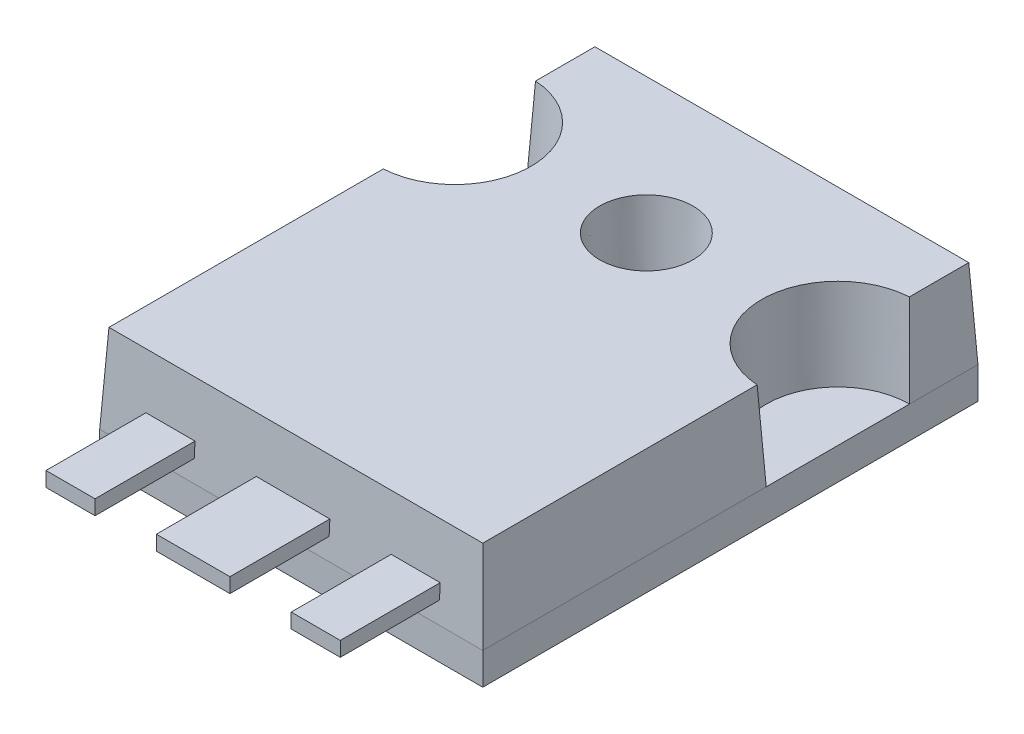
ISO-10303-21;
HEADER;
FILE_DESCRIPTION(('STEP AP214'),'2;1');
FILE_NAME('part.step','',(''),(''),'','','');
FILE_SCHEMA(('AUTOMOTIVE_DESIGN { 1 0 10303 214 1 1 1 1 }'));
ENDSEC;
DATA;
#1=APPLICATION_CONTEXT('core data for automotive mechanical design processes');
#2=APPLICATION_PROTOCOL_DEFINITION('international standard','automotive_design',2000,#1);
#3=PRODUCT_CONTEXT('',#1,'mechanical');
#4=PRODUCT('Part','Part','',(#3));
#5=PRODUCT_RELATED_PRODUCT_CATEGORY('part','',(#4));
#6=PRODUCT_DEFINITION_FORMATION('','',#4);
#7=PRODUCT_DEFINITION_CONTEXT('part definition',#1,'design');
#8=PRODUCT_DEFINITION('design','',#6,#7);
#9=PRODUCT_DEFINITION_SHAPE('','',#8);
#10=(LENGTH_UNIT() NAMED_UNIT(*) SI_UNIT(.MILLI.,.METRE.));
#11=(NAMED_UNIT(*) PLANE_ANGLE_UNIT() SI_UNIT($,.RADIAN.));
#12=(NAMED_UNIT(*) SI_UNIT($,.STERADIAN.) SOLID_ANGLE_UNIT());
#13=UNCERTAINTY_MEASURE_WITH_UNIT(LENGTH_MEASURE(1.E-05),#10,'distance_accuracy_value','');
#14=(GEOMETRIC_REPRESENTATION_CONTEXT(3) GLOBAL_UNCERTAINTY_ASSIGNED_CONTEXT((#13)) GLOBAL_UNIT_ASSIGNED_CONTEXT((#10,
#11,#12)) REPRESENTATION_CONTEXT('',''));
#15=CARTESIAN_POINT('',(0.,0.,0.));
#16=DIRECTION('',(0.,0.,1.));
#17=DIRECTION('',(1.,0.,0.));
#18=AXIS2_PLACEMENT_3D('',#15,#16,#17);
#19=CARTESIAN_POINT('',(0.,1.3,0.));
#20=DIRECTION('',(0.,0.0523359562429439,0.998629534754574));
#21=DIRECTION('',(0.,-0.998629534754574,0.0523359562429439));
#22=AXIS2_PLACEMENT_3D('',#19,#20,#21);
#23=PLANE('',#22);
#24=DIRECTION('',(-1.,0.,0.));
#25=VECTOR('',#24,1.);
#26=CARTESIAN_POINT('',(0.,2.15,-0.0445466123905851));
#27=LINE('',#26,#25);
#28=CARTESIAN_POINT('',(6.3105,2.15,-0.0445466123905851));
#29=VERTEX_POINT('',#28);
#30=CARTESIAN_POINT('',(9.3105,2.15,-0.0445466123905851));
#31=VERTEX_POINT('',#30);
#32=EDGE_CURVE('E441',#29,#31,#27,.F.);
#33=ORIENTED_EDGE('',*,*,#32,.F.);
#34=DIRECTION('',(0.,0.998629534754574,-0.0523359562429439));
#35=VECTOR('',#34,1.);
#36=CARTESIAN_POINT('',(6.3105,1.3,0.));
#37=LINE('',#36,#35);
#38=CARTESIAN_POINT('',(6.3105,2.75,-0.0759912799604098));
#39=VERTEX_POINT('',#38);
#40=EDGE_CURVE('E439',#39,#29,#37,.F.);
#41=ORIENTED_EDGE('',*,*,#40,.F.);
#42=DIRECTION('',(-1.,0.,0.));
#43=VECTOR('',#42,1.);
#44=CARTESIAN_POINT('',(0.,2.75,-0.0759912799604098));
#45=LINE('',#44,#43);
#46=CARTESIAN_POINT('',(9.3105,2.75,-0.0759912799604098));
#47=VERTEX_POINT('',#46);
#48=EDGE_CURVE('E433',#39,#47,#45,.F.);
#49=ORIENTED_EDGE('',*,*,#48,.T.);
#50=DIRECTION('',(0.,0.998629534754574,-0.0523359562429439));
#51=VECTOR('',#50,1.);
#52=CARTESIAN_POINT('',(9.3105,1.3,0.));
#53=LINE('',#52,#51);
#54=EDGE_CURVE('E436',#47,#31,#53,.F.);
#55=ORIENTED_EDGE('',*,*,#54,.T.);
#56=EDGE_LOOP('',(#33,#41,#49,#55));
#57=FACE_BOUND('',#56,.T.);
#58=DIRECTION('',(1.,0.,0.));
#59=VECTOR('',#58,1.);
#60=CARTESIAN_POINT('',(0.,1.3,0.));
#61=LINE('',#60,#59);
#62=CARTESIAN_POINT('',(0.,1.3,0.));
#63=VERTEX_POINT('',#62);
#64=CARTESIAN_POINT('',(15.621,1.3,0.));
#65=VERTEX_POINT('',#64);
#66=EDGE_CURVE('E541',#63,#65,#61,.T.);
#67=ORIENTED_EDGE('',*,*,#66,.T.);
#68=DIRECTION('',(0.052264427688714,-0.997264688634237,0.052264427688714));
#69=VECTOR('',#68,1.);
#70=CARTESIAN_POINT('',(15.621,1.3,0.));
#71=LINE('',#70,#69);
#72=CARTESIAN_POINT('',(15.4323319945811,4.9,-0.188668005418949));
#73=VERTEX_POINT('',#72);
#74=EDGE_CURVE('E345',#73,#65,#71,.T.);
#75=ORIENTED_EDGE('',*,*,#74,.F.);
#76=DIRECTION('',(-1.,0.,0.));
#77=VECTOR('',#76,1.);
#78=CARTESIAN_POINT('',(0.,4.9,-0.188668005418948));
#79=LINE('',#78,#77);
#80=CARTESIAN_POINT('',(0.188668005418948,4.9,-0.188668005418949));
#81=VERTEX_POINT('',#80);
#82=EDGE_CURVE('E521',#81,#73,#79,.F.);
#83=ORIENTED_EDGE('',*,*,#82,.F.);
#84=DIRECTION('',(-0.052264427688714,-0.997264688634237,0.052264427688714));
#85=VECTOR('',#84,1.);
#86=CARTESIAN_POINT('',(0.,1.3,0.));
#87=LINE('',#86,#85);
#88=EDGE_CURVE('E298',#81,#63,#87,.T.);
#89=ORIENTED_EDGE('',*,*,#88,.T.);
#90=EDGE_LOOP('',(#67,#75,#83,#89));
#91=FACE_BOUND('',#90,.T.);
#92=DIRECTION('',(-1.,0.,0.));
#93=VECTOR('',#92,1.);
#94=CARTESIAN_POINT('',(0.,2.15,-0.0445466123905851));
#95=LINE('',#94,#93);
#96=CARTESIAN_POINT('',(1.8105,2.15,-0.0445466123905851));
#97=VERTEX_POINT('',#96);
#98=CARTESIAN_POINT('',(3.8105,2.15,-0.0445466123905851));
#99=VERTEX_POINT('',#98);
#100=EDGE_CURVE('E431',#97,#99,#95,.F.);
#101=ORIENTED_EDGE('',*,*,#100,.F.);
#102=DIRECTION('',(0.,0.998629534754574,-0.0523359562429439));
#103=VECTOR('',#102,1.);
#104=CARTESIAN_POINT('',(1.8105,1.3,0.));
#105=LINE('',#104,#103);
#106=CARTESIAN_POINT('',(1.8105,2.75,-0.0759912799604098));
#107=VERTEX_POINT('',#106);
#108=EDGE_CURVE('E429',#107,#97,#105,.F.);
#109=ORIENTED_EDGE('',*,*,#108,.F.);
#110=DIRECTION('',(-1.,0.,0.));
#111=VECTOR('',#110,1.);
#112=CARTESIAN_POINT('',(0.,2.75,-0.0759912799604098));
#113=LINE('',#112,#111);
#114=CARTESIAN_POINT('',(3.8105,2.75,-0.0759912799604098));
#115=VERTEX_POINT('',#114);
#116=EDGE_CURVE('E423',#107,#115,#113,.F.);
#117=ORIENTED_EDGE('',*,*,#116,.T.);
#118=DIRECTION('',(0.,0.998629534754574,-0.0523359562429439));
#119=VECTOR('',#118,1.);
#120=CARTESIAN_POINT('',(3.8105,1.3,0.));
#121=LINE('',#120,#119);
#122=EDGE_CURVE('E426',#115,#99,#121,.F.);
#123=ORIENTED_EDGE('',*,*,#122,.T.);
#124=EDGE_LOOP('',(#101,#109,#117,#123));
#125=FACE_BOUND('',#124,.T.);
#126=DIRECTION('',(-1.,0.,0.));
#127=VECTOR('',#126,1.);
#128=CARTESIAN_POINT('',(0.,2.15,-0.0445466123905851));
#129=LINE('',#128,#127);
#130=CARTESIAN_POINT('',(11.8105,2.15,-0.0445466123905851));
#131=VERTEX_POINT('',#130);
#132=CARTESIAN_POINT('',(13.8105,2.15,-0.0445466123905851));
#133=VERTEX_POINT('',#132);
#134=EDGE_CURVE('E11',#131,#133,#129,.F.);
#135=ORIENTED_EDGE('',*,*,#134,.F.);
#136=DIRECTION('',(0.,0.998629534754574,-0.0523359562429439));
#137=VECTOR('',#136,1.);
#138=CARTESIAN_POINT('',(11.8105,1.3,0.));
#139=LINE('',#138,#137);
#140=CARTESIAN_POINT('',(11.8105,2.75,-0.0759912799604098));
#141=VERTEX_POINT('',#140);
#142=EDGE_CURVE('E59',#141,#131,#139,.F.);
#143=ORIENTED_EDGE('',*,*,#142,.F.);
#144=DIRECTION('',(-1.,0.,0.));
#145=VECTOR('',#144,1.);
#146=CARTESIAN_POINT('',(0.,2.75,-0.0759912799604098));
#147=LINE('',#146,#145);
#148=CARTESIAN_POINT('',(13.8105,2.75,-0.0759912799604098));
#149=VERTEX_POINT('',#148);
#150=EDGE_CURVE('E218',#141,#149,#147,.F.);
#151=ORIENTED_EDGE('',*,*,#150,.T.);
#152=DIRECTION('',(0.,0.998629534754574,-0.0523359562429439));
#153=VECTOR('',#152,1.);
#154=CARTESIAN_POINT('',(13.8105,1.3,0.));
#155=LINE('',#154,#153);
#156=EDGE_CURVE('E444',#149,#133,#155,.F.);
#157=ORIENTED_EDGE('',*,*,#156,.T.);
#158=EDGE_LOOP('',(#135,#143,#151,#157));
#159=FACE_BOUND('',#158,.T.);
#160=ADVANCED_FACE('F51',(#57,#91,#125,#159),#23,.T.);
#161=CARTESIAN_POINT('',(0.,1.3,0.));
#162=DIRECTION('',(0.,-1.,0.));
#163=DIRECTION('',(0.,0.,-1.));
#164=AXIS2_PLACEMENT_3D('',#161,#162,#163);
#165=PLANE('',#164);
#166=DIRECTION('',(0.,0.,1.));
#167=VECTOR('',#166,1.);
#168=CARTESIAN_POINT('',(0.,1.3,0.));
#169=LINE('',#168,#167);
#170=CARTESIAN_POINT('',(0.,1.3,-17.3995));
#171=VERTEX_POINT('',#170);
#172=CARTESIAN_POINT('',(0.,1.3,-11.5575));
#173=VERTEX_POINT('',#172);
#174=EDGE_CURVE('E413',#171,#173,#169,.T.);
#175=ORIENTED_EDGE('',*,*,#174,.T.);
#176=CARTESIAN_POINT('',(0.,1.3,-14.4785));
#177=DIRECTION('',(0.,1.,0.));
#178=DIRECTION('',(0.,0.,1.));
#179=AXIS2_PLACEMENT_3D('',#176,#177,#178);
#180=CIRCLE('',#179,2.921);
#181=EDGE_CURVE('E273',#173,#171,#180,.T.);
#182=ORIENTED_EDGE('',*,*,#181,.T.);
#183=EDGE_LOOP('',(#175,#182));
#184=FACE_BOUND('',#183,.T.);
#185=ADVANCED_FACE('F360',(#184),#165,.F.);
#186=DIRECTION('',(0.,0.,-1.));
#187=VECTOR('',#186,1.);
#188=CARTESIAN_POINT('',(15.621,1.3,0.));
#189=LINE('',#188,#187);
#190=CARTESIAN_POINT('',(15.621,1.3,-11.5575));
#191=VERTEX_POINT('',#190);
#192=CARTESIAN_POINT('',(15.621,1.3,-17.3995));
#193=VERTEX_POINT('',#192);
#194=EDGE_CURVE('E544',#191,#193,#189,.T.);
#195=ORIENTED_EDGE('',*,*,#194,.T.);
#196=CARTESIAN_POINT('',(15.621,1.3,-14.4785));
#197=DIRECTION('',(0.,1.,0.));
#198=DIRECTION('',(0.,0.,1.));
#199=AXIS2_PLACEMENT_3D('',#196,#197,#198);
#200=CIRCLE('',#199,2.921);
#201=EDGE_CURVE('E279',#193,#191,#200,.T.);
#202=ORIENTED_EDGE('',*,*,#201,.T.);
#203=EDGE_LOOP('',(#195,#202));
#204=FACE_BOUND('',#203,.T.);
#205=ADVANCED_FACE('F369',(#204),#165,.F.);
#206=CARTESIAN_POINT('',(0.,0.,0.));
#207=DIRECTION('',(0.,-1.,0.));
#208=DIRECTION('',(0.,0.,-1.));
#209=AXIS2_PLACEMENT_3D('',#206,#207,#208);
#210=PLANE('',#209);
#211=DIRECTION('',(0.,0.,1.));
#212=VECTOR('',#211,1.);
#213=CARTESIAN_POINT('',(0.,0.,0.));
#214=LINE('',#213,#212);
#215=CARTESIAN_POINT('',(0.,0.,-20.193));
#216=VERTEX_POINT('',#215);
#217=CARTESIAN_POINT('',(0.,0.,0.));
#218=VERTEX_POINT('',#217);
#219=EDGE_CURVE('E401',#216,#218,#214,.T.);
#220=ORIENTED_EDGE('',*,*,#219,.F.);
#221=DIRECTION('',(-1.,0.,0.));
#222=VECTOR('',#221,1.);
#223=CARTESIAN_POINT('',(0.,0.,-20.193));
#224=LINE('',#223,#222);
#225=CARTESIAN_POINT('',(15.621,0.,-20.193));
#226=VERTEX_POINT('',#225);
#227=EDGE_CURVE('E411',#226,#216,#224,.T.);
#228=ORIENTED_EDGE('',*,*,#227,.F.);
#229=DIRECTION('',(0.,0.,-1.));
#230=VECTOR('',#229,1.);
#231=CARTESIAN_POINT('',(15.621,0.,0.));
#232=LINE('',#231,#230);
#233=CARTESIAN_POINT('',(15.621,0.,0.));
#234=VERTEX_POINT('',#233);
#235=EDGE_CURVE('E400',#234,#226,#232,.T.);
#236=ORIENTED_EDGE('',*,*,#235,.F.);
#237=DIRECTION('',(1.,0.,0.));
#238=VECTOR('',#237,1.);
#239=CARTESIAN_POINT('',(0.,0.,0.));
#240=LINE('',#239,#238);
#241=EDGE_CURVE('E390',#218,#234,#240,.T.);
#242=ORIENTED_EDGE('',*,*,#241,.F.);
#243=EDGE_LOOP('',(#220,#228,#236,#242));
#244=FACE_BOUND('',#243,.T.);
#245=CARTESIAN_POINT('',(7.8105,0.,-14.4785));
#246=DIRECTION('',(0.,1.,0.));
#247=DIRECTION('',(0.,0.,1.));
#248=AXIS2_PLACEMENT_3D('',#245,#246,#247);
#249=CIRCLE('',#248,1.7145);
#250=CARTESIAN_POINT('',(7.8105,0.,-12.764));
#251=VERTEX_POINT('',#250);
#252=EDGE_CURVE('E297',#251,#251,#249,.T.);
#253=ORIENTED_EDGE('',*,*,#252,.T.);
#254=EDGE_LOOP('',(#253));
#255=FACE_BOUND('',#254,.T.);
#256=ADVANCED_FACE('F371',(#244,#255),#210,.T.);
#257=CARTESIAN_POINT('',(0.,1.3,0.));
#258=DIRECTION('',(1.,0.,0.));
#259=DIRECTION('',(0.,0.,-1.));
#260=AXIS2_PLACEMENT_3D('',#257,#258,#259);
#261=PLANE('',#260);
#262=ORIENTED_EDGE('',*,*,#219,.T.);
#263=DIRECTION('',(0.,-1.,0.));
#264=VECTOR('',#263,1.);
#265=CARTESIAN_POINT('',(0.,1.3,0.));
#266=LINE('',#265,#264);
#267=EDGE_CURVE('E396',#63,#218,#266,.T.);
#268=ORIENTED_EDGE('',*,*,#267,.F.);
#269=DIRECTION('',(0.,0.,1.));
#270=VECTOR('',#269,1.);
#271=CARTESIAN_POINT('',(0.,1.3,0.));
#272=LINE('',#271,#270);
#273=EDGE_CURVE('E276',#173,#63,#272,.T.);
#274=ORIENTED_EDGE('',*,*,#273,.F.);
#275=ORIENTED_EDGE('',*,*,#174,.F.);
#276=CARTESIAN_POINT('',(0.,1.3,-20.193));
#277=VERTEX_POINT('',#276);
#278=EDGE_CURVE('E538',#277,#171,#169,.T.);
#279=ORIENTED_EDGE('',*,*,#278,.F.);
#280=DIRECTION('',(0.,-1.,0.));
#281=VECTOR('',#280,1.);
#282=CARTESIAN_POINT('',(0.,1.3,-20.193));
#283=LINE('',#282,#281);
#284=EDGE_CURVE('E417',#277,#216,#283,.T.);
#285=ORIENTED_EDGE('',*,*,#284,.T.);
#286=EDGE_LOOP('',(#262,#268,#274,#275,#279,#285));
#287=FACE_BOUND('',#286,.T.);
#288=ADVANCED_FACE('F53',(#287),#261,.F.);
#289=CARTESIAN_POINT('',(0.,1.3,0.));
#290=DIRECTION('',(0.,0.,-1.));
#291=DIRECTION('',(-1.,0.,0.));
#292=AXIS2_PLACEMENT_3D('',#289,#290,#291);
#293=PLANE('',#292);
#294=ORIENTED_EDGE('',*,*,#241,.T.);
#295=DIRECTION('',(0.,-1.,0.));
#296=VECTOR('',#295,1.);
#297=CARTESIAN_POINT('',(15.621,1.3,0.));
#298=LINE('',#297,#296);
#299=EDGE_CURVE('E393',#65,#234,#298,.T.);
#300=ORIENTED_EDGE('',*,*,#299,.F.);
#301=ORIENTED_EDGE('',*,*,#66,.F.);
#302=ORIENTED_EDGE('',*,*,#267,.T.);
#303=EDGE_LOOP('',(#294,#300,#301,#302));
#304=FACE_BOUND('',#303,.T.);
#305=ADVANCED_FACE('F380',(#304),#293,.F.);
#306=CARTESIAN_POINT('',(15.621,1.3,0.));
#307=DIRECTION('',(-1.,0.,0.));
#308=DIRECTION('',(0.,0.,1.));
#309=AXIS2_PLACEMENT_3D('',#306,#307,#308);
#310=PLANE('',#309);
#311=ORIENTED_EDGE('',*,*,#235,.T.);
#312=DIRECTION('',(0.,-1.,0.));
#313=VECTOR('',#312,1.);
#314=CARTESIAN_POINT('',(15.621,1.3,-20.193));
#315=LINE('',#314,#313);
#316=CARTESIAN_POINT('',(15.621,1.3,-20.193));
#317=VERTEX_POINT('',#316);
#318=EDGE_CURVE('E407',#317,#226,#315,.T.);
#319=ORIENTED_EDGE('',*,*,#318,.F.);
#320=DIRECTION('',(0.,0.,-1.));
#321=VECTOR('',#320,1.);
#322=CARTESIAN_POINT('',(15.621,1.3,0.));
#323=LINE('',#322,#321);
#324=EDGE_CURVE('E282',#193,#317,#323,.T.);
#325=ORIENTED_EDGE('',*,*,#324,.F.);
#326=ORIENTED_EDGE('',*,*,#194,.F.);
#327=EDGE_CURVE('E406',#65,#191,#189,.T.);
#328=ORIENTED_EDGE('',*,*,#327,.F.);
#329=ORIENTED_EDGE('',*,*,#299,.T.);
#330=EDGE_LOOP('',(#311,#319,#325,#326,#328,#329));
#331=FACE_BOUND('',#330,.T.);
#332=ADVANCED_FACE('F377',(#331),#310,.F.);
#333=CARTESIAN_POINT('',(0.,1.3,-20.193));
#334=DIRECTION('',(0.,0.,1.));
#335=DIRECTION('',(1.,0.,0.));
#336=AXIS2_PLACEMENT_3D('',#333,#334,#335);
#337=PLANE('',#336);
#338=ORIENTED_EDGE('',*,*,#227,.T.);
#339=ORIENTED_EDGE('',*,*,#284,.F.);
#340=DIRECTION('',(-1.,0.,0.));
#341=VECTOR('',#340,1.);
#342=CARTESIAN_POINT('',(0.,1.3,-20.193));
#343=LINE('',#342,#341);
#344=EDGE_CURVE('E420',#317,#277,#343,.T.);
#345=ORIENTED_EDGE('',*,*,#344,.F.);
#346=ORIENTED_EDGE('',*,*,#318,.T.);
#347=EDGE_LOOP('',(#338,#339,#345,#346));
#348=FACE_BOUND('',#347,.T.);
#349=ADVANCED_FACE('F365',(#348),#337,.F.);
#350=CARTESIAN_POINT('',(7.8105,1.3,-14.4785));
#351=DIRECTION('',(0.,-1.,0.));
#352=DIRECTION('',(0.,0.,-1.));
#353=AXIS2_PLACEMENT_3D('',#350,#351,#352);
#354=CYLINDRICAL_SURFACE('',#353,1.7145);
#355=CARTESIAN_POINT('',(7.8105,1.3,-14.4785));
#356=DIRECTION('',(0.,1.,0.));
#357=DIRECTION('',(0.,0.,1.));
#358=AXIS2_PLACEMENT_3D('',#355,#356,#357);
#359=CIRCLE('',#358,1.7145);
#360=CARTESIAN_POINT('',(7.8105,1.3,-12.764));
#361=VERTEX_POINT('',#360);
#362=EDGE_CURVE('E269',#361,#361,#359,.F.);
#363=ORIENTED_EDGE('',*,*,#362,.F.);
#364=EDGE_LOOP('',(#363));
#365=FACE_BOUND('',#364,.T.);
#366=ORIENTED_EDGE('',*,*,#252,.F.);
#367=EDGE_LOOP('',(#366));
#368=FACE_BOUND('',#367,.T.);
#369=ADVANCED_FACE('F362',(#365,#368),#354,.F.);
#370=CARTESIAN_POINT('',(0.,1.3,-14.4785));
#371=DIRECTION('',(0.,1.,0.));
#372=DIRECTION('',(0.,0.,1.));
#373=AXIS2_PLACEMENT_3D('',#370,#371,#372);
#374=CONICAL_SURFACE('',#373,2.921,0.0523598775598299);
#375=ORIENTED_EDGE('',*,*,#181,.F.);
#376=CARTESIAN_POINT('',(0.188668005418947,4.9,-11.3745606501322));
#377=CARTESIAN_POINT('',(0.157220886528015,4.2999532260069,-11.4041273452191));
#378=CARTESIAN_POINT('',(0.125774993588073,3.69992984455219,-11.4341556382947));
#379=CARTESIAN_POINT('',(0.0628856584483328,2.49992984455047,-11.4951354215499));
#380=CARTESIAN_POINT('',(0.0314422162486257,1.89995322600517,-11.5260869117635));
#381=CARTESIAN_POINT('',(0.,1.3,-11.5575));
#382=B_SPLINE_CURVE_WITH_KNOTS('',3,(#376,#377,#378,#379,#380,#381),.UNSPECIFIED.,.F.,.F.,(4,2,
4),(0.,1.80479012844749,3.60958032357924),.UNSPECIFIED.);
#383=CARTESIAN_POINT('',(0.188668005418947,4.9,-11.3745606501322));
#384=VERTEX_POINT('',#383);
#385=EDGE_CURVE('E289',#384,#173,#382,.T.);
#386=ORIENTED_EDGE('',*,*,#385,.F.);
#387=CARTESIAN_POINT('',(0.,4.9,-14.4785));
#388=DIRECTION('',(0.,1.,0.));
#389=DIRECTION('',(0.,0.,1.));
#390=AXIS2_PLACEMENT_3D('',#387,#388,#389);
#391=CIRCLE('',#390,3.10966800541895);
#392=CARTESIAN_POINT('',(0.188668005418945,4.9,-17.5824393498678));
#393=VERTEX_POINT('',#392);
#394=EDGE_CURVE('E288',#384,#393,#391,.T.);
#395=ORIENTED_EDGE('',*,*,#394,.T.);
#396=CARTESIAN_POINT('',(0.188668005418945,4.9,-17.5824393498678));
#397=CARTESIAN_POINT('',(0.157220886528014,4.2999532260069,-17.5528726547809));
#398=CARTESIAN_POINT('',(0.125774993588072,3.69992984455219,-17.5228443617053));
#399=CARTESIAN_POINT('',(0.0628856584483318,2.49992984455047,-17.4618645784501));
#400=CARTESIAN_POINT('',(0.0314422162486247,1.89995322600517,-17.4309130882365));
#401=CARTESIAN_POINT('',(0.,1.3,-17.3995));
#402=B_SPLINE_CURVE_WITH_KNOTS('',3,(#396,#397,#398,#399,#400,#401),.UNSPECIFIED.,.F.,.F.,(4,2,
4),(0.,1.80479012844749,3.60958032357924),.UNSPECIFIED.);
#403=EDGE_CURVE('E299',#393,#171,#402,.T.);
#404=ORIENTED_EDGE('',*,*,#403,.T.);
#405=EDGE_LOOP('',(#375,#386,#395,#404));
#406=FACE_BOUND('',#405,.T.);
#407=ADVANCED_FACE('F306',(#406),#374,.F.);
#408=CARTESIAN_POINT('',(0.,1.3,0.));
#409=DIRECTION('',(-0.998629534754574,0.0523359562429439,0.));
#410=DIRECTION('',(-0.0523359562429439,-0.998629534754574,0.));
#411=AXIS2_PLACEMENT_3D('',#408,#409,#410);
#412=PLANE('',#411);
#413=ORIENTED_EDGE('',*,*,#273,.T.);
#414=ORIENTED_EDGE('',*,*,#88,.F.);
#415=DIRECTION('',(0.,0.,-1.));
#416=VECTOR('',#415,1.);
#417=CARTESIAN_POINT('',(0.188668005418948,4.9,0.));
#418=LINE('',#417,#416);
#419=EDGE_CURVE('E514',#384,#81,#418,.F.);
#420=ORIENTED_EDGE('',*,*,#419,.F.);
#421=ORIENTED_EDGE('',*,*,#385,.T.);
#422=EDGE_LOOP('',(#413,#414,#420,#421));
#423=FACE_BOUND('',#422,.T.);
#424=ADVANCED_FACE('F309',(#423),#412,.T.);
#425=CARTESIAN_POINT('',(15.621,1.3,0.));
#426=DIRECTION('',(0.998629534754574,0.0523359562429439,0.));
#427=DIRECTION('',(-0.0523359562429439,0.998629534754574,0.));
#428=AXIS2_PLACEMENT_3D('',#425,#426,#427);
#429=PLANE('',#428);
#430=ORIENTED_EDGE('',*,*,#327,.T.);
#431=CARTESIAN_POINT('',(15.432331994581,4.9,-11.3745606501322));
#432=CARTESIAN_POINT('',(15.463779113472,4.2999532260069,-11.4041273452191));
#433=CARTESIAN_POINT('',(15.4952250064119,3.69992984455219,-11.4341556382947));
#434=CARTESIAN_POINT('',(15.5581143415517,2.49992984455047,-11.4951354215499));
#435=CARTESIAN_POINT('',(15.5895577837514,1.89995322600517,-11.5260869117635));
#436=CARTESIAN_POINT('',(15.621,1.3,-11.5575));
#437=B_SPLINE_CURVE_WITH_KNOTS('',3,(#431,#432,#433,#434,#435,#436),.UNSPECIFIED.,.F.,.F.,(4,2,
4),(0.,1.80479012844749,3.60958032357924),.UNSPECIFIED.);
#438=CARTESIAN_POINT('',(15.432331994581,4.9,-11.3745606501322));
#439=VERTEX_POINT('',#438);
#440=EDGE_CURVE('E338',#439,#191,#437,.T.);
#441=ORIENTED_EDGE('',*,*,#440,.F.);
#442=DIRECTION('',(0.,0.,1.));
#443=VECTOR('',#442,1.);
#444=CARTESIAN_POINT('',(15.4323319945811,4.9,0.));
#445=LINE('',#444,#443);
#446=EDGE_CURVE('E525',#73,#439,#445,.F.);
#447=ORIENTED_EDGE('',*,*,#446,.F.);
#448=ORIENTED_EDGE('',*,*,#74,.T.);
#449=EDGE_LOOP('',(#430,#441,#447,#448));
#450=FACE_BOUND('',#449,.T.);
#451=ADVANCED_FACE('F312',(#450),#429,.T.);
#452=CARTESIAN_POINT('',(15.621,1.3,-14.4785));
#453=DIRECTION('',(0.,1.,0.));
#454=DIRECTION('',(0.,0.,1.));
#455=AXIS2_PLACEMENT_3D('',#452,#453,#454);
#456=CONICAL_SURFACE('',#455,2.921,0.0523598775598299);
#457=ORIENTED_EDGE('',*,*,#201,.F.);
#458=CARTESIAN_POINT('',(15.432331994581,4.9,-17.5824393498678));
#459=CARTESIAN_POINT('',(15.463779113472,4.2999532260069,-17.5528726547809));
#460=CARTESIAN_POINT('',(15.4952250064119,3.69992984455219,-17.5228443617053));
#461=CARTESIAN_POINT('',(15.5581143415517,2.49992984455047,-17.4618645784501));
#462=CARTESIAN_POINT('',(15.5895577837514,1.89995322600517,-17.4309130882365));
#463=CARTESIAN_POINT('',(15.621,1.3,-17.3995));
#464=B_SPLINE_CURVE_WITH_KNOTS('',3,(#458,#459,#460,#461,#462,#463),.UNSPECIFIED.,.F.,.F.,(4,2,
4),(0.,1.80479012844749,3.60958032357924),.UNSPECIFIED.);
#465=CARTESIAN_POINT('',(15.432331994581,4.9,-17.5824393498678));
#466=VERTEX_POINT('',#465);
#467=EDGE_CURVE('E331',#466,#193,#464,.T.);
#468=ORIENTED_EDGE('',*,*,#467,.F.);
#469=CARTESIAN_POINT('',(15.621,4.9,-14.4785));
#470=DIRECTION('',(0.,1.,0.));
#471=DIRECTION('',(0.,0.,1.));
#472=AXIS2_PLACEMENT_3D('',#469,#470,#471);
#473=CIRCLE('',#472,3.10966800541895);
#474=EDGE_CURVE('E527',#466,#439,#473,.T.);
#475=ORIENTED_EDGE('',*,*,#474,.T.);
#476=ORIENTED_EDGE('',*,*,#440,.T.);
#477=EDGE_LOOP('',(#457,#468,#475,#476));
#478=FACE_BOUND('',#477,.T.);
#479=ADVANCED_FACE('F321',(#478),#456,.F.);
#480=CARTESIAN_POINT('',(15.621,1.3,0.));
#481=DIRECTION('',(0.998629534754574,0.0523359562429439,0.));
#482=DIRECTION('',(-0.0523359562429439,0.998629534754574,0.));
#483=AXIS2_PLACEMENT_3D('',#480,#481,#482);
#484=PLANE('',#483);
#485=ORIENTED_EDGE('',*,*,#324,.T.);
#486=DIRECTION('',(0.052264427688714,-0.997264688634237,-0.052264427688714));
#487=VECTOR('',#486,1.);
#488=CARTESIAN_POINT('',(15.5783301387562,2.11418945484018,-20.1503301387562));
#489=LINE('',#488,#487);
#490=CARTESIAN_POINT('',(15.432331994581,4.9,-20.0043319945811));
#491=VERTEX_POINT('',#490);
#492=EDGE_CURVE('E568',#491,#317,#489,.T.);
#493=ORIENTED_EDGE('',*,*,#492,.F.);
#494=DIRECTION('',(0.,0.,1.));
#495=VECTOR('',#494,1.);
#496=CARTESIAN_POINT('',(15.4323319945811,4.9,0.));
#497=LINE('',#496,#495);
#498=EDGE_CURVE('E530',#466,#491,#497,.F.);
#499=ORIENTED_EDGE('',*,*,#498,.F.);
#500=ORIENTED_EDGE('',*,*,#467,.T.);
#501=EDGE_LOOP('',(#485,#493,#499,#500));
#502=FACE_BOUND('',#501,.T.);
#503=ADVANCED_FACE('F325',(#502),#484,.T.);
#504=CARTESIAN_POINT('',(0.,1.3,-20.193));
#505=DIRECTION('',(0.,0.0523359562429439,-0.998629534754574));
#506=DIRECTION('',(0.,0.998629534754574,0.0523359562429439));
#507=AXIS2_PLACEMENT_3D('',#504,#505,#506);
#508=PLANE('',#507);
#509=ORIENTED_EDGE('',*,*,#344,.T.);
#510=DIRECTION('',(-0.052264427688714,-0.997264688634237,-0.052264427688714));
#511=VECTOR('',#510,1.);
#512=CARTESIAN_POINT('',(0.0551586011200871,2.35248880747633,-20.1378413988799));
#513=LINE('',#512,#511);
#514=CARTESIAN_POINT('',(0.188668005418945,4.9,-20.0043319945811));
#515=VERTEX_POINT('',#514);
#516=EDGE_CURVE('E566',#515,#277,#513,.T.);
#517=ORIENTED_EDGE('',*,*,#516,.F.);
#518=DIRECTION('',(1.,0.,0.));
#519=VECTOR('',#518,1.);
#520=CARTESIAN_POINT('',(0.,4.9,-20.0043319945811));
#521=LINE('',#520,#519);
#522=EDGE_CURVE('E533',#491,#515,#521,.F.);
#523=ORIENTED_EDGE('',*,*,#522,.F.);
#524=ORIENTED_EDGE('',*,*,#492,.T.);
#525=EDGE_LOOP('',(#509,#517,#523,#524));
#526=FACE_BOUND('',#525,.T.);
#527=ADVANCED_FACE('F353',(#526),#508,.T.);
#528=CARTESIAN_POINT('',(7.8105,1.3,-14.4785));
#529=DIRECTION('',(0.,1.,0.));
#530=DIRECTION('',(0.,0.,1.));
#531=AXIS2_PLACEMENT_3D('',#528,#529,#530);
#532=CONICAL_SURFACE('',#531,1.7145,0.0523598775598299);
#533=CARTESIAN_POINT('',(7.8105,4.9,-14.4785));
#534=DIRECTION('',(0.,1.,0.));
#535=DIRECTION('',(0.,0.,1.));
#536=AXIS2_PLACEMENT_3D('',#533,#534,#535);
#537=CIRCLE('',#536,1.90316800541895);
#538=CARTESIAN_POINT('',(7.8105,4.9,-12.575331994581));
#539=VERTEX_POINT('',#538);
#540=EDGE_CURVE('E285',#539,#539,#537,.F.);
#541=ORIENTED_EDGE('',*,*,#540,.F.);
#542=EDGE_LOOP('',(#541));
#543=FACE_BOUND('',#542,.T.);
#544=ORIENTED_EDGE('',*,*,#362,.T.);
#545=EDGE_LOOP('',(#544));
#546=FACE_BOUND('',#545,.T.);
#547=ADVANCED_FACE('F319',(#543,#546),#532,.F.);
#548=CARTESIAN_POINT('',(0.,1.3,0.));
#549=DIRECTION('',(-0.998629534754574,0.0523359562429439,0.));
#550=DIRECTION('',(-0.0523359562429439,-0.998629534754574,0.));
#551=AXIS2_PLACEMENT_3D('',#548,#549,#550);
#552=PLANE('',#551);
#553=ORIENTED_EDGE('',*,*,#278,.T.);
#554=ORIENTED_EDGE('',*,*,#403,.F.);
#555=DIRECTION('',(0.,0.,-1.));
#556=VECTOR('',#555,1.);
#557=CARTESIAN_POINT('',(0.188668005418948,4.9,0.));
#558=LINE('',#557,#556);
#559=EDGE_CURVE('E517',#515,#393,#558,.F.);
#560=ORIENTED_EDGE('',*,*,#559,.F.);
#561=ORIENTED_EDGE('',*,*,#516,.T.);
#562=EDGE_LOOP('',(#553,#554,#560,#561));
#563=FACE_BOUND('',#562,.T.);
#564=ADVANCED_FACE('F314',(#563),#552,.T.);
#565=CARTESIAN_POINT('',(0.,4.9,0.));
#566=DIRECTION('',(0.,1.,0.));
#567=DIRECTION('',(0.,0.,1.));
#568=AXIS2_PLACEMENT_3D('',#565,#566,#567);
#569=PLANE('',#568);
#570=ORIENTED_EDGE('',*,*,#540,.T.);
#571=EDGE_LOOP('',(#570));
#572=FACE_BOUND('',#571,.T.);
#573=ORIENTED_EDGE('',*,*,#394,.F.);
#574=ORIENTED_EDGE('',*,*,#419,.T.);
#575=ORIENTED_EDGE('',*,*,#82,.T.);
#576=ORIENTED_EDGE('',*,*,#446,.T.);
#577=ORIENTED_EDGE('',*,*,#474,.F.);
#578=ORIENTED_EDGE('',*,*,#498,.T.);
#579=ORIENTED_EDGE('',*,*,#522,.T.);
#580=ORIENTED_EDGE('',*,*,#559,.T.);
#581=EDGE_LOOP('',(#573,#574,#575,#576,#577,#578,#579,#580));
#582=FACE_BOUND('',#581,.T.);
#583=ADVANCED_FACE('F318',(#572,#582),#569,.T.);
#584=CARTESIAN_POINT('',(1.8105,2.15,0.));
#585=DIRECTION('',(1.,0.,0.));
#586=DIRECTION('',(0.,0.,-1.));
#587=AXIS2_PLACEMENT_3D('',#584,#585,#586);
#588=PLANE('',#587);
#589=DIRECTION('',(0.,0.,-1.));
#590=VECTOR('',#589,1.);
#591=CARTESIAN_POINT('',(1.8105,2.75,0.));
#592=LINE('',#591,#590);
#593=CARTESIAN_POINT('',(1.8105,2.75,4.));
#594=VERTEX_POINT('',#593);
#595=EDGE_CURVE('E248',#594,#107,#592,.T.);
#596=ORIENTED_EDGE('',*,*,#595,.T.);
#597=ORIENTED_EDGE('',*,*,#108,.T.);
#598=DIRECTION('',(0.,0.,-1.));
#599=VECTOR('',#598,1.);
#600=CARTESIAN_POINT('',(1.8105,2.15,0.));
#601=LINE('',#600,#599);
#602=CARTESIAN_POINT('',(1.8105,2.15,4.));
#603=VERTEX_POINT('',#602);
#604=EDGE_CURVE('E257',#603,#97,#601,.T.);
#605=ORIENTED_EDGE('',*,*,#604,.F.);
#606=DIRECTION('',(0.,1.,0.));
#607=VECTOR('',#606,1.);
#608=CARTESIAN_POINT('',(1.8105,2.15,4.));
#609=LINE('',#608,#607);
#610=EDGE_CURVE('E266',#603,#594,#609,.T.);
#611=ORIENTED_EDGE('',*,*,#610,.T.);
#612=EDGE_LOOP('',(#596,#597,#605,#611));
#613=FACE_BOUND('',#612,.T.);
#614=ADVANCED_FACE('F496',(#613),#588,.F.);
#615=CARTESIAN_POINT('',(3.8105,2.15,0.));
#616=DIRECTION('',(1.,0.,0.));
#617=DIRECTION('',(0.,0.,-1.));
#618=AXIS2_PLACEMENT_3D('',#615,#616,#617);
#619=PLANE('',#618);
#620=ORIENTED_EDGE('',*,*,#122,.F.);
#621=DIRECTION('',(0.,0.,-1.));
#622=VECTOR('',#621,1.);
#623=CARTESIAN_POINT('',(3.8105,2.75,0.));
#624=LINE('',#623,#622);
#625=CARTESIAN_POINT('',(3.8105,2.75,4.));
#626=VERTEX_POINT('',#625);
#627=EDGE_CURVE('E255',#626,#115,#624,.T.);
#628=ORIENTED_EDGE('',*,*,#627,.F.);
#629=DIRECTION('',(0.,1.,0.));
#630=VECTOR('',#629,1.);
#631=CARTESIAN_POINT('',(3.8105,2.15,4.));
#632=LINE('',#631,#630);
#633=CARTESIAN_POINT('',(3.8105,2.15,4.));
#634=VERTEX_POINT('',#633);
#635=EDGE_CURVE('E267',#634,#626,#632,.T.);
#636=ORIENTED_EDGE('',*,*,#635,.F.);
#637=DIRECTION('',(0.,0.,-1.));
#638=VECTOR('',#637,1.);
#639=CARTESIAN_POINT('',(3.8105,2.15,0.));
#640=LINE('',#639,#638);
#641=EDGE_CURVE('E263',#634,#99,#640,.T.);
#642=ORIENTED_EDGE('',*,*,#641,.T.);
#643=EDGE_LOOP('',(#620,#628,#636,#642));
#644=FACE_BOUND('',#643,.T.);
#645=ADVANCED_FACE('F492',(#644),#619,.T.);
#646=CARTESIAN_POINT('',(0.,2.15,0.));
#647=DIRECTION('',(0.,1.,0.));
#648=DIRECTION('',(0.,0.,1.));
#649=AXIS2_PLACEMENT_3D('',#646,#647,#648);
#650=PLANE('',#649);
#651=ORIENTED_EDGE('',*,*,#604,.T.);
#652=ORIENTED_EDGE('',*,*,#100,.T.);
#653=ORIENTED_EDGE('',*,*,#641,.F.);
#654=DIRECTION('',(1.,0.,0.));
#655=VECTOR('',#654,1.);
#656=CARTESIAN_POINT('',(0.,2.15,4.));
#657=LINE('',#656,#655);
#658=EDGE_CURVE('E260',#603,#634,#657,.T.);
#659=ORIENTED_EDGE('',*,*,#658,.F.);
#660=EDGE_LOOP('',(#651,#652,#653,#659));
#661=FACE_BOUND('',#660,.T.);
#662=ADVANCED_FACE('F488',(#661),#650,.F.);
#663=CARTESIAN_POINT('',(0.,2.75,0.));
#664=DIRECTION('',(0.,1.,0.));
#665=DIRECTION('',(0.,0.,1.));
#666=AXIS2_PLACEMENT_3D('',#663,#664,#665);
#667=PLANE('',#666);
#668=ORIENTED_EDGE('',*,*,#116,.F.);
#669=ORIENTED_EDGE('',*,*,#595,.F.);
#670=DIRECTION('',(1.,0.,0.));
#671=VECTOR('',#670,1.);
#672=CARTESIAN_POINT('',(0.,2.75,4.));
#673=LINE('',#672,#671);
#674=EDGE_CURVE('E252',#594,#626,#673,.T.);
#675=ORIENTED_EDGE('',*,*,#674,.T.);
#676=ORIENTED_EDGE('',*,*,#627,.T.);
#677=EDGE_LOOP('',(#668,#669,#675,#676));
#678=FACE_BOUND('',#677,.T.);
#679=ADVANCED_FACE('F485',(#678),#667,.T.);
#680=CARTESIAN_POINT('',(0.,2.15,4.));
#681=DIRECTION('',(0.,0.,1.));
#682=DIRECTION('',(1.,0.,0.));
#683=AXIS2_PLACEMENT_3D('',#680,#681,#682);
#684=PLANE('',#683);
#685=ORIENTED_EDGE('',*,*,#635,.T.);
#686=ORIENTED_EDGE('',*,*,#674,.F.);
#687=ORIENTED_EDGE('',*,*,#610,.F.);
#688=ORIENTED_EDGE('',*,*,#658,.T.);
#689=EDGE_LOOP('',(#685,#686,#687,#688));
#690=FACE_BOUND('',#689,.T.);
#691=ADVANCED_FACE('F483',(#690),#684,.T.);
#692=CARTESIAN_POINT('',(6.3105,2.15,0.));
#693=DIRECTION('',(1.,0.,0.));
#694=DIRECTION('',(0.,0.,-1.));
#695=AXIS2_PLACEMENT_3D('',#692,#693,#694);
#696=PLANE('',#695);
#697=DIRECTION('',(0.,0.,-1.));
#698=VECTOR('',#697,1.);
#699=CARTESIAN_POINT('',(6.3105,2.75,0.));
#700=LINE('',#699,#698);
#701=CARTESIAN_POINT('',(6.3105,2.75,4.));
#702=VERTEX_POINT('',#701);
#703=EDGE_CURVE('E229',#702,#39,#700,.T.);
#704=ORIENTED_EDGE('',*,*,#703,.T.);
#705=ORIENTED_EDGE('',*,*,#40,.T.);
#706=DIRECTION('',(0.,0.,-1.));
#707=VECTOR('',#706,1.);
#708=CARTESIAN_POINT('',(6.3105,2.15,0.));
#709=LINE('',#708,#707);
#710=CARTESIAN_POINT('',(6.3105,2.15,4.));
#711=VERTEX_POINT('',#710);
#712=EDGE_CURVE('E237',#711,#29,#709,.T.);
#713=ORIENTED_EDGE('',*,*,#712,.F.);
#714=DIRECTION('',(0.,1.,0.));
#715=VECTOR('',#714,1.);
#716=CARTESIAN_POINT('',(6.3105,2.15,4.));
#717=LINE('',#716,#715);
#718=EDGE_CURVE('E245',#711,#702,#717,.T.);
#719=ORIENTED_EDGE('',*,*,#718,.T.);
#720=EDGE_LOOP('',(#704,#705,#713,#719));
#721=FACE_BOUND('',#720,.T.);
#722=ADVANCED_FACE('F476',(#721),#696,.F.);
#723=CARTESIAN_POINT('',(9.3105,2.15,0.));
#724=DIRECTION('',(1.,0.,0.));
#725=DIRECTION('',(0.,0.,-1.));
#726=AXIS2_PLACEMENT_3D('',#723,#724,#725);
#727=PLANE('',#726);
#728=ORIENTED_EDGE('',*,*,#54,.F.);
#729=DIRECTION('',(0.,0.,-1.));
#730=VECTOR('',#729,1.);
#731=CARTESIAN_POINT('',(9.3105,2.75,0.));
#732=LINE('',#731,#730);
#733=CARTESIAN_POINT('',(9.3105,2.75,4.));
#734=VERTEX_POINT('',#733);
#735=EDGE_CURVE('E74',#734,#47,#732,.T.);
#736=ORIENTED_EDGE('',*,*,#735,.F.);
#737=DIRECTION('',(0.,1.,0.));
#738=VECTOR('',#737,1.);
#739=CARTESIAN_POINT('',(9.3105,2.15,4.));
#740=LINE('',#739,#738);
#741=CARTESIAN_POINT('',(9.3105,2.15,4.));
#742=VERTEX_POINT('',#741);
#743=EDGE_CURVE('E246',#742,#734,#740,.T.);
#744=ORIENTED_EDGE('',*,*,#743,.F.);
#745=DIRECTION('',(0.,0.,-1.));
#746=VECTOR('',#745,1.);
#747=CARTESIAN_POINT('',(9.3105,2.15,0.));
#748=LINE('',#747,#746);
#749=EDGE_CURVE('E242',#742,#31,#748,.T.);
#750=ORIENTED_EDGE('',*,*,#749,.T.);
#751=EDGE_LOOP('',(#728,#736,#744,#750));
#752=FACE_BOUND('',#751,.T.);
#753=ADVANCED_FACE('F472',(#752),#727,.T.);
#754=CARTESIAN_POINT('',(0.,2.15,0.));
#755=DIRECTION('',(0.,1.,0.));
#756=DIRECTION('',(0.,0.,1.));
#757=AXIS2_PLACEMENT_3D('',#754,#755,#756);
#758=PLANE('',#757);
#759=ORIENTED_EDGE('',*,*,#712,.T.);
#760=ORIENTED_EDGE('',*,*,#32,.T.);
#761=ORIENTED_EDGE('',*,*,#749,.F.);
#762=DIRECTION('',(-1.,0.,0.));
#763=VECTOR('',#762,1.);
#764=CARTESIAN_POINT('',(0.,2.15,4.));
#765=LINE('',#764,#763);
#766=EDGE_CURVE('E240',#742,#711,#765,.T.);
#767=ORIENTED_EDGE('',*,*,#766,.T.);
#768=EDGE_LOOP('',(#759,#760,#761,#767));
#769=FACE_BOUND('',#768,.T.);
#770=ADVANCED_FACE('F469',(#769),#758,.F.);
#771=CARTESIAN_POINT('',(0.,2.75,0.));
#772=DIRECTION('',(0.,1.,0.));
#773=DIRECTION('',(0.,0.,1.));
#774=AXIS2_PLACEMENT_3D('',#771,#772,#773);
#775=PLANE('',#774);
#776=ORIENTED_EDGE('',*,*,#48,.F.);
#777=ORIENTED_EDGE('',*,*,#703,.F.);
#778=DIRECTION('',(-1.,0.,0.));
#779=VECTOR('',#778,1.);
#780=CARTESIAN_POINT('',(0.,2.75,4.));
#781=LINE('',#780,#779);
#782=EDGE_CURVE('E233',#734,#702,#781,.T.);
#783=ORIENTED_EDGE('',*,*,#782,.F.);
#784=ORIENTED_EDGE('',*,*,#735,.T.);
#785=EDGE_LOOP('',(#776,#777,#783,#784));
#786=FACE_BOUND('',#785,.T.);
#787=ADVANCED_FACE('F466',(#786),#775,.T.);
#788=CARTESIAN_POINT('',(0.,2.15,4.));
#789=DIRECTION('',(0.,0.,-1.));
#790=DIRECTION('',(-1.,0.,0.));
#791=AXIS2_PLACEMENT_3D('',#788,#789,#790);
#792=PLANE('',#791);
#793=ORIENTED_EDGE('',*,*,#743,.T.);
#794=ORIENTED_EDGE('',*,*,#782,.T.);
#795=ORIENTED_EDGE('',*,*,#718,.F.);
#796=ORIENTED_EDGE('',*,*,#766,.F.);
#797=EDGE_LOOP('',(#793,#794,#795,#796));
#798=FACE_BOUND('',#797,.T.);
#799=ADVANCED_FACE('F460',(#798),#792,.F.);
#800=CARTESIAN_POINT('',(11.8105,2.15,0.));
#801=DIRECTION('',(1.,0.,0.));
#802=DIRECTION('',(0.,0.,-1.));
#803=AXIS2_PLACEMENT_3D('',#800,#801,#802);
#804=PLANE('',#803);
#805=DIRECTION('',(0.,0.,-1.));
#806=VECTOR('',#805,1.);
#807=CARTESIAN_POINT('',(11.8105,2.75,0.));
#808=LINE('',#807,#806);
#809=CARTESIAN_POINT('',(11.8105,2.75,4.));
#810=VERTEX_POINT('',#809);
#811=EDGE_CURVE('E205',#810,#141,#808,.T.);
#812=ORIENTED_EDGE('',*,*,#811,.T.);
#813=ORIENTED_EDGE('',*,*,#142,.T.);
#814=DIRECTION('',(0.,0.,-1.));
#815=VECTOR('',#814,1.);
#816=CARTESIAN_POINT('',(11.8105,2.15,0.));
#817=LINE('',#816,#815);
#818=CARTESIAN_POINT('',(11.8105,2.15,4.));
#819=VERTEX_POINT('',#818);
#820=EDGE_CURVE('E208',#819,#131,#817,.T.);
#821=ORIENTED_EDGE('',*,*,#820,.F.);
#822=DIRECTION('',(0.,1.,0.));
#823=VECTOR('',#822,1.);
#824=CARTESIAN_POINT('',(11.8105,2.15,4.));
#825=LINE('',#824,#823);
#826=EDGE_CURVE('E202',#819,#810,#825,.T.);
#827=ORIENTED_EDGE('',*,*,#826,.T.);
#828=EDGE_LOOP('',(#812,#813,#821,#827));
#829=FACE_BOUND('',#828,.T.);
#830=ADVANCED_FACE('F204',(#829),#804,.F.);
#831=CARTESIAN_POINT('',(13.8105,2.15,0.));
#832=DIRECTION('',(1.,0.,0.));
#833=DIRECTION('',(0.,0.,-1.));
#834=AXIS2_PLACEMENT_3D('',#831,#832,#833);
#835=PLANE('',#834);
#836=ORIENTED_EDGE('',*,*,#156,.F.);
#837=DIRECTION('',(0.,0.,-1.));
#838=VECTOR('',#837,1.);
#839=CARTESIAN_POINT('',(13.8105,2.75,0.));
#840=LINE('',#839,#838);
#841=CARTESIAN_POINT('',(13.8105,2.75,4.));
#842=VERTEX_POINT('',#841);
#843=EDGE_CURVE('E66',#842,#149,#840,.T.);
#844=ORIENTED_EDGE('',*,*,#843,.F.);
#845=DIRECTION('',(0.,1.,0.));
#846=VECTOR('',#845,1.);
#847=CARTESIAN_POINT('',(13.8105,2.15,4.));
#848=LINE('',#847,#846);
#849=CARTESIAN_POINT('',(13.8105,2.15,4.));
#850=VERTEX_POINT('',#849);
#851=EDGE_CURVE('E212',#850,#842,#848,.T.);
#852=ORIENTED_EDGE('',*,*,#851,.F.);
#853=DIRECTION('',(0.,0.,-1.));
#854=VECTOR('',#853,1.);
#855=CARTESIAN_POINT('',(13.8105,2.15,0.));
#856=LINE('',#855,#854);
#857=EDGE_CURVE('E213',#850,#133,#856,.T.);
#858=ORIENTED_EDGE('',*,*,#857,.T.);
#859=EDGE_LOOP('',(#836,#844,#852,#858));
#860=FACE_BOUND('',#859,.T.);
#861=ADVANCED_FACE('F452',(#860),#835,.T.);
#862=CARTESIAN_POINT('',(0.,2.15,0.));
#863=DIRECTION('',(0.,1.,0.));
#864=DIRECTION('',(0.,0.,1.));
#865=AXIS2_PLACEMENT_3D('',#862,#863,#864);
#866=PLANE('',#865);
#867=ORIENTED_EDGE('',*,*,#820,.T.);
#868=ORIENTED_EDGE('',*,*,#134,.T.);
#869=ORIENTED_EDGE('',*,*,#857,.F.);
#870=DIRECTION('',(-1.,0.,0.));
#871=VECTOR('',#870,1.);
#872=CARTESIAN_POINT('',(0.,2.15,4.));
#873=LINE('',#872,#871);
#874=EDGE_CURVE('E225',#850,#819,#873,.T.);
#875=ORIENTED_EDGE('',*,*,#874,.T.);
#876=EDGE_LOOP('',(#867,#868,#869,#875));
#877=FACE_BOUND('',#876,.T.);
#878=ADVANCED_FACE('F449',(#877),#866,.F.);
#879=CARTESIAN_POINT('',(0.,2.75,0.));
#880=DIRECTION('',(0.,1.,0.));
#881=DIRECTION('',(0.,0.,1.));
#882=AXIS2_PLACEMENT_3D('',#879,#880,#881);
#883=PLANE('',#882);
#884=ORIENTED_EDGE('',*,*,#150,.F.);
#885=ORIENTED_EDGE('',*,*,#811,.F.);
#886=DIRECTION('',(-1.,0.,0.));
#887=VECTOR('',#886,1.);
#888=CARTESIAN_POINT('',(0.,2.75,4.));
#889=LINE('',#888,#887);
#890=EDGE_CURVE('E216',#842,#810,#889,.T.);
#891=ORIENTED_EDGE('',*,*,#890,.F.);
#892=ORIENTED_EDGE('',*,*,#843,.T.);
#893=EDGE_LOOP('',(#884,#885,#891,#892));
#894=FACE_BOUND('',#893,.T.);
#895=ADVANCED_FACE('F215',(#894),#883,.T.);
#896=CARTESIAN_POINT('',(0.,2.15,4.));
#897=DIRECTION('',(0.,0.,-1.));
#898=DIRECTION('',(-1.,0.,0.));
#899=AXIS2_PLACEMENT_3D('',#896,#897,#898);
#900=PLANE('',#899);
#901=ORIENTED_EDGE('',*,*,#851,.T.);
#902=ORIENTED_EDGE('',*,*,#890,.T.);
#903=ORIENTED_EDGE('',*,*,#826,.F.);
#904=ORIENTED_EDGE('',*,*,#874,.F.);
#905=EDGE_LOOP('',(#901,#902,#903,#904));
#906=FACE_BOUND('',#905,.T.);
#907=ADVANCED_FACE('F220',(#906),#900,.F.);
#908=CLOSED_SHELL('',(#160,#185,#205,#256,#288,#305,#332,#349,#369,#407,#424,#451,#479,#503,
#527,#547,#564,#583,#614,#645,#662,#679,#691,#722,#753,#770,#787,#799,#830,#861,#878,#895,#907));
#909=MANIFOLD_SOLID_BREP('B2',#908);
#910=ADVANCED_BREP_SHAPE_REPRESENTATION('',(#18,#909),#14);
#911=SHAPE_DEFINITION_REPRESENTATION(#9,#910);
ENDSEC;
END-ISO-10303-21;
